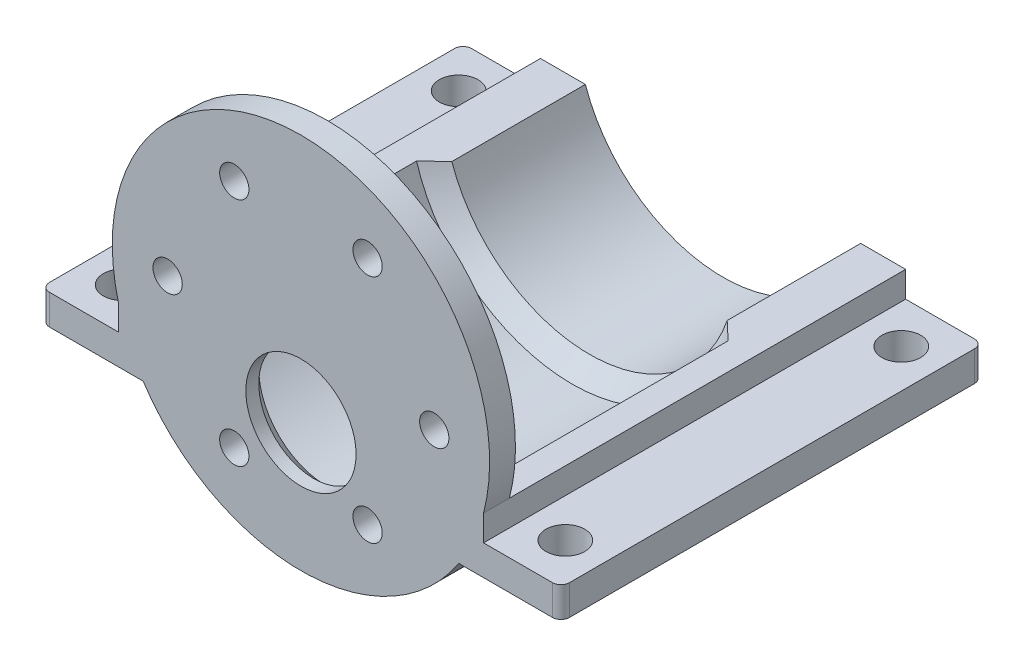
ISO-10303-21;
HEADER;
FILE_DESCRIPTION(('STEP AP214'),'2;1');
FILE_NAME('part.step','',(''),(''),'','','');
FILE_SCHEMA(('AUTOMOTIVE_DESIGN { 1 0 10303 214 1 1 1 1 }'));
ENDSEC;
DATA;
#1=APPLICATION_CONTEXT('core data for automotive mechanical design processes');
#2=APPLICATION_PROTOCOL_DEFINITION('international standard','automotive_design',2000,#1);
#3=PRODUCT_CONTEXT('',#1,'mechanical');
#4=PRODUCT('Part','Part','',(#3));
#5=PRODUCT_RELATED_PRODUCT_CATEGORY('part','',(#4));
#6=PRODUCT_DEFINITION_FORMATION('','',#4);
#7=PRODUCT_DEFINITION_CONTEXT('part definition',#1,'design');
#8=PRODUCT_DEFINITION('design','',#6,#7);
#9=PRODUCT_DEFINITION_SHAPE('','',#8);
#10=(LENGTH_UNIT() NAMED_UNIT(*) SI_UNIT(.MILLI.,.METRE.));
#11=(NAMED_UNIT(*) PLANE_ANGLE_UNIT() SI_UNIT($,.RADIAN.));
#12=(NAMED_UNIT(*) SI_UNIT($,.STERADIAN.) SOLID_ANGLE_UNIT());
#13=UNCERTAINTY_MEASURE_WITH_UNIT(LENGTH_MEASURE(1.E-05),#10,'distance_accuracy_value','');
#14=(GEOMETRIC_REPRESENTATION_CONTEXT(3) GLOBAL_UNCERTAINTY_ASSIGNED_CONTEXT((#13)) GLOBAL_UNIT_ASSIGNED_CONTEXT((#10,
#11,#12)) REPRESENTATION_CONTEXT('',''));
#15=CARTESIAN_POINT('',(0.,0.,0.));
#16=DIRECTION('',(0.,0.,1.));
#17=DIRECTION('',(1.,0.,0.));
#18=AXIS2_PLACEMENT_3D('',#15,#16,#17);
#19=CARTESIAN_POINT('',(0.,0.,91.));
#20=DIRECTION('',(0.,0.,1.));
#21=DIRECTION('',(1.,0.,0.));
#22=AXIS2_PLACEMENT_3D('',#19,#20,#21);
#23=CYLINDRICAL_SURFACE('',#22,21.9);
#24=CARTESIAN_POINT('',(0.,0.,45.));
#25=DIRECTION('',(0.,0.,1.));
#26=DIRECTION('',(1.,0.,0.));
#27=AXIS2_PLACEMENT_3D('',#24,#25,#26);
#28=CIRCLE('',#27,21.9);
#29=CARTESIAN_POINT('',(-18.3196615689264,-12.,45.));
#30=VERTEX_POINT('',#29);
#31=CARTESIAN_POINT('',(18.3196615689264,-12.,45.));
#32=VERTEX_POINT('',#31);
#33=EDGE_CURVE('E187',#30,#32,#28,.T.);
#34=ORIENTED_EDGE('',*,*,#33,.T.);
#35=DIRECTION('',(0.,0.,-1.));
#36=VECTOR('',#35,1.);
#37=CARTESIAN_POINT('',(18.3196615689264,-12.,107.527476698662));
#38=LINE('',#37,#36);
#39=CARTESIAN_POINT('',(18.3196615689264,-12.,94.));
#40=VERTEX_POINT('',#39);
#41=EDGE_CURVE('E226',#40,#32,#38,.T.);
#42=ORIENTED_EDGE('',*,*,#41,.F.);
#43=CARTESIAN_POINT('',(0.,0.,94.));
#44=DIRECTION('',(0.,0.,1.));
#45=DIRECTION('',(1.,0.,0.));
#46=AXIS2_PLACEMENT_3D('',#43,#44,#45);
#47=CIRCLE('',#46,21.9);
#48=CARTESIAN_POINT('',(-18.3196615689264,-12.,94.));
#49=VERTEX_POINT('',#48);
#50=EDGE_CURVE('E287',#49,#40,#47,.T.);
#51=ORIENTED_EDGE('',*,*,#50,.F.);
#52=DIRECTION('',(0.,0.,-1.));
#53=VECTOR('',#52,1.);
#54=CARTESIAN_POINT('',(-18.3196615689264,-12.,107.527476698662));
#55=LINE('',#54,#53);
#56=EDGE_CURVE('E239',#49,#30,#55,.T.);
#57=ORIENTED_EDGE('',*,*,#56,.T.);
#58=EDGE_LOOP('',(#34,#42,#51,#57));
#59=FACE_BOUND('',#58,.T.);
#60=ADVANCED_FACE('F43',(#59),#23,.T.);
#61=CARTESIAN_POINT('',(0.,0.,91.));
#62=DIRECTION('',(0.,0.,1.));
#63=DIRECTION('',(1.,0.,0.));
#64=AXIS2_PLACEMENT_3D('',#61,#62,#63);
#65=PLANE('',#64);
#66=CARTESIAN_POINT('',(0.,-7.,91.));
#67=DIRECTION('',(0.,0.,1.));
#68=DIRECTION('',(1.,0.,0.));
#69=AXIS2_PLACEMENT_3D('',#66,#67,#68);
#70=CIRCLE('',#69,7.89999999999998);
#71=CARTESIAN_POINT('',(7.89999999999998,-7.,91.));
#72=VERTEX_POINT('',#71);
#73=EDGE_CURVE('E547',#72,#72,#70,.T.);
#74=ORIENTED_EDGE('',*,*,#73,.T.);
#75=EDGE_LOOP('',(#74));
#76=FACE_BOUND('',#75,.T.);
#77=CARTESIAN_POINT('',(-7.73750000000007,-13.4017431235641,91.));
#78=DIRECTION('',(0.,0.,1.));
#79=DIRECTION('',(1.,0.,0.));
#80=AXIS2_PLACEMENT_3D('',#77,#78,#79);
#81=CIRCLE('',#80,1.7);
#82=CARTESIAN_POINT('',(-6.03750000000007,-13.4017431235641,91.));
#83=VERTEX_POINT('',#82);
#84=EDGE_CURVE('E299',#83,#83,#81,.T.);
#85=ORIENTED_EDGE('',*,*,#84,.T.);
#86=EDGE_LOOP('',(#85));
#87=FACE_BOUND('',#86,.T.);
#88=CARTESIAN_POINT('',(7.73749999999997,-13.4017431235642,91.));
#89=DIRECTION('',(0.,0.,1.));
#90=DIRECTION('',(1.,0.,0.));
#91=AXIS2_PLACEMENT_3D('',#88,#89,#90);
#92=CIRCLE('',#91,1.7);
#93=CARTESIAN_POINT('',(9.43749999999996,-13.4017431235642,91.));
#94=VERTEX_POINT('',#93);
#95=EDGE_CURVE('E296',#94,#94,#92,.T.);
#96=ORIENTED_EDGE('',*,*,#95,.T.);
#97=EDGE_LOOP('',(#96));
#98=FACE_BOUND('',#97,.T.);
#99=CARTESIAN_POINT('',(15.475,0.,91.));
#100=DIRECTION('',(0.,0.,1.));
#101=DIRECTION('',(1.,0.,0.));
#102=AXIS2_PLACEMENT_3D('',#99,#100,#101);
#103=CIRCLE('',#102,1.69999999999999);
#104=CARTESIAN_POINT('',(17.175,0.,91.));
#105=VERTEX_POINT('',#104);
#106=EDGE_CURVE('E293',#105,#105,#103,.T.);
#107=ORIENTED_EDGE('',*,*,#106,.T.);
#108=EDGE_LOOP('',(#107));
#109=FACE_BOUND('',#108,.T.);
#110=CARTESIAN_POINT('',(7.73750000000017,13.4017431235641,91.));
#111=DIRECTION('',(0.,0.,1.));
#112=DIRECTION('',(1.,0.,0.));
#113=AXIS2_PLACEMENT_3D('',#110,#111,#112);
#114=CIRCLE('',#113,1.7);
#115=CARTESIAN_POINT('',(9.43750000000017,13.4017431235641,91.));
#116=VERTEX_POINT('',#115);
#117=EDGE_CURVE('E290',#116,#116,#114,.T.);
#118=ORIENTED_EDGE('',*,*,#117,.T.);
#119=EDGE_LOOP('',(#118));
#120=FACE_BOUND('',#119,.T.);
#121=CARTESIAN_POINT('',(-7.73749999999986,13.4017431235643,91.));
#122=DIRECTION('',(0.,0.,1.));
#123=DIRECTION('',(1.,0.,0.));
#124=AXIS2_PLACEMENT_3D('',#121,#122,#123);
#125=CIRCLE('',#124,1.7);
#126=CARTESIAN_POINT('',(-6.03749999999986,13.4017431235643,91.));
#127=VERTEX_POINT('',#126);
#128=EDGE_CURVE('E286',#127,#127,#125,.T.);
#129=ORIENTED_EDGE('',*,*,#128,.T.);
#130=EDGE_LOOP('',(#129));
#131=FACE_BOUND('',#130,.T.);
#132=CARTESIAN_POINT('',(-15.475,1.23149278341851E-13,91.));
#133=DIRECTION('',(0.,0.,1.));
#134=DIRECTION('',(1.,0.,0.));
#135=AXIS2_PLACEMENT_3D('',#132,#133,#134);
#136=CIRCLE('',#135,1.7);
#137=CARTESIAN_POINT('',(-13.775,1.23149278341851E-13,91.));
#138=VERTEX_POINT('',#137);
#139=EDGE_CURVE('E283',#138,#138,#136,.T.);
#140=ORIENTED_EDGE('',*,*,#139,.T.);
#141=EDGE_LOOP('',(#140));
#142=FACE_BOUND('',#141,.T.);
#143=DIRECTION('',(1.,0.,0.));
#144=VECTOR('',#143,1.);
#145=CARTESIAN_POINT('',(0.,-5.5,91.));
#146=LINE('',#145,#144);
#147=CARTESIAN_POINT('',(18.0820352836731,-5.5,91.));
#148=VERTEX_POINT('',#147);
#149=CARTESIAN_POINT('',(21.1981131235778,-5.50000000000001,91.));
#150=VERTEX_POINT('',#149);
#151=EDGE_CURVE('E197',#148,#150,#146,.T.);
#152=ORIENTED_EDGE('',*,*,#151,.F.);
#153=CARTESIAN_POINT('',(0.,0.,91.));
#154=DIRECTION('',(0.,0.,1.));
#155=DIRECTION('',(1.,0.,0.));
#156=AXIS2_PLACEMENT_3D('',#153,#154,#155);
#157=CIRCLE('',#156,18.9);
#158=CARTESIAN_POINT('',(-18.0820352836731,-5.5,91.));
#159=VERTEX_POINT('',#158);
#160=EDGE_CURVE('E276',#159,#148,#157,.T.);
#161=ORIENTED_EDGE('',*,*,#160,.F.);
#162=DIRECTION('',(-1.,0.,0.));
#163=VECTOR('',#162,1.);
#164=CARTESIAN_POINT('',(0.,-5.5,91.));
#165=LINE('',#164,#163);
#166=CARTESIAN_POINT('',(-21.1981131235778,-5.5,91.));
#167=VERTEX_POINT('',#166);
#168=EDGE_CURVE('E273',#159,#167,#165,.T.);
#169=ORIENTED_EDGE('',*,*,#168,.T.);
#170=CARTESIAN_POINT('',(0.,0.,91.));
#171=DIRECTION('',(0.,0.,1.));
#172=DIRECTION('',(1.,0.,0.));
#173=AXIS2_PLACEMENT_3D('',#170,#171,#172);
#174=CIRCLE('',#173,21.9);
#175=EDGE_CURVE('E302',#150,#167,#174,.T.);
#176=ORIENTED_EDGE('',*,*,#175,.F.);
#177=EDGE_LOOP('',(#152,#161,#169,#176));
#178=FACE_BOUND('',#177,.T.);
#179=ADVANCED_FACE('F373',(#76,#87,#98,#109,#120,#131,#142,#178),#65,.F.);
#180=CARTESIAN_POINT('',(-7.73750000000007,-13.4017431235641,91.));
#181=DIRECTION('',(0.,0.,1.));
#182=DIRECTION('',(1.,0.,0.));
#183=AXIS2_PLACEMENT_3D('',#180,#181,#182);
#184=CYLINDRICAL_SURFACE('',#183,1.7);
#185=ORIENTED_EDGE('',*,*,#84,.F.);
#186=EDGE_LOOP('',(#185));
#187=FACE_BOUND('',#186,.T.);
#188=CARTESIAN_POINT('',(-7.73750000000007,-13.4017431235641,94.));
#189=DIRECTION('',(0.,0.,1.));
#190=DIRECTION('',(1.,0.,0.));
#191=AXIS2_PLACEMENT_3D('',#188,#189,#190);
#192=CIRCLE('',#191,1.7);
#193=CARTESIAN_POINT('',(-6.03750000000007,-13.4017431235641,94.));
#194=VERTEX_POINT('',#193);
#195=EDGE_CURVE('E323',#194,#194,#192,.T.);
#196=ORIENTED_EDGE('',*,*,#195,.T.);
#197=EDGE_LOOP('',(#196));
#198=FACE_BOUND('',#197,.T.);
#199=ADVANCED_FACE('F376',(#187,#198),#184,.F.);
#200=CARTESIAN_POINT('',(7.73749999999997,-13.4017431235642,91.));
#201=DIRECTION('',(0.,0.,1.));
#202=DIRECTION('',(1.,0.,0.));
#203=AXIS2_PLACEMENT_3D('',#200,#201,#202);
#204=CYLINDRICAL_SURFACE('',#203,1.7);
#205=ORIENTED_EDGE('',*,*,#95,.F.);
#206=EDGE_LOOP('',(#205));
#207=FACE_BOUND('',#206,.T.);
#208=CARTESIAN_POINT('',(7.73749999999997,-13.4017431235642,94.));
#209=DIRECTION('',(0.,0.,1.));
#210=DIRECTION('',(1.,0.,0.));
#211=AXIS2_PLACEMENT_3D('',#208,#209,#210);
#212=CIRCLE('',#211,1.7);
#213=CARTESIAN_POINT('',(9.43749999999996,-13.4017431235642,94.));
#214=VERTEX_POINT('',#213);
#215=EDGE_CURVE('E320',#214,#214,#212,.T.);
#216=ORIENTED_EDGE('',*,*,#215,.T.);
#217=EDGE_LOOP('',(#216));
#218=FACE_BOUND('',#217,.T.);
#219=ADVANCED_FACE('F388',(#207,#218),#204,.F.);
#220=CARTESIAN_POINT('',(0.,-7.,91.));
#221=DIRECTION('',(0.,0.,1.));
#222=DIRECTION('',(1.,0.,0.));
#223=AXIS2_PLACEMENT_3D('',#220,#221,#222);
#224=CYLINDRICAL_SURFACE('',#223,6.4);
#225=CARTESIAN_POINT('',(0.,-7.,92.5));
#226=DIRECTION('',(0.,0.,1.));
#227=DIRECTION('',(1.,0.,0.));
#228=AXIS2_PLACEMENT_3D('',#225,#226,#227);
#229=CIRCLE('',#228,6.4);
#230=CARTESIAN_POINT('',(6.4,-7.,92.5));
#231=VERTEX_POINT('',#230);
#232=EDGE_CURVE('E544',#231,#231,#229,.F.);
#233=ORIENTED_EDGE('',*,*,#232,.T.);
#234=EDGE_LOOP('',(#233));
#235=FACE_BOUND('',#234,.T.);
#236=CARTESIAN_POINT('',(0.,-7.,94.));
#237=DIRECTION('',(0.,0.,1.));
#238=DIRECTION('',(1.,0.,0.));
#239=AXIS2_PLACEMENT_3D('',#236,#237,#238);
#240=CIRCLE('',#239,6.4);
#241=CARTESIAN_POINT('',(6.4,-7.,94.));
#242=VERTEX_POINT('',#241);
#243=EDGE_CURVE('E317',#242,#242,#240,.T.);
#244=ORIENTED_EDGE('',*,*,#243,.T.);
#245=EDGE_LOOP('',(#244));
#246=FACE_BOUND('',#245,.T.);
#247=ADVANCED_FACE('F392',(#235,#246),#224,.F.);
#248=CARTESIAN_POINT('',(15.475,0.,91.));
#249=DIRECTION('',(0.,0.,1.));
#250=DIRECTION('',(1.,0.,0.));
#251=AXIS2_PLACEMENT_3D('',#248,#249,#250);
#252=CYLINDRICAL_SURFACE('',#251,1.69999999999999);
#253=ORIENTED_EDGE('',*,*,#106,.F.);
#254=EDGE_LOOP('',(#253));
#255=FACE_BOUND('',#254,.T.);
#256=CARTESIAN_POINT('',(15.475,0.,94.));
#257=DIRECTION('',(0.,0.,1.));
#258=DIRECTION('',(1.,0.,0.));
#259=AXIS2_PLACEMENT_3D('',#256,#257,#258);
#260=CIRCLE('',#259,1.69999999999999);
#261=CARTESIAN_POINT('',(17.175,0.,94.));
#262=VERTEX_POINT('',#261);
#263=EDGE_CURVE('E314',#262,#262,#260,.T.);
#264=ORIENTED_EDGE('',*,*,#263,.T.);
#265=EDGE_LOOP('',(#264));
#266=FACE_BOUND('',#265,.T.);
#267=ADVANCED_FACE('F396',(#255,#266),#252,.F.);
#268=CARTESIAN_POINT('',(7.73750000000017,13.4017431235641,91.));
#269=DIRECTION('',(0.,0.,1.));
#270=DIRECTION('',(1.,0.,0.));
#271=AXIS2_PLACEMENT_3D('',#268,#269,#270);
#272=CYLINDRICAL_SURFACE('',#271,1.7);
#273=ORIENTED_EDGE('',*,*,#117,.F.);
#274=EDGE_LOOP('',(#273));
#275=FACE_BOUND('',#274,.T.);
#276=CARTESIAN_POINT('',(7.73750000000017,13.4017431235641,94.));
#277=DIRECTION('',(0.,0.,1.));
#278=DIRECTION('',(1.,0.,0.));
#279=AXIS2_PLACEMENT_3D('',#276,#277,#278);
#280=CIRCLE('',#279,1.7);
#281=CARTESIAN_POINT('',(9.43750000000017,13.4017431235641,94.));
#282=VERTEX_POINT('',#281);
#283=EDGE_CURVE('E311',#282,#282,#280,.T.);
#284=ORIENTED_EDGE('',*,*,#283,.T.);
#285=EDGE_LOOP('',(#284));
#286=FACE_BOUND('',#285,.T.);
#287=ADVANCED_FACE('F400',(#275,#286),#272,.F.);
#288=CARTESIAN_POINT('',(-7.73749999999986,13.4017431235643,91.));
#289=DIRECTION('',(0.,0.,1.));
#290=DIRECTION('',(1.,0.,0.));
#291=AXIS2_PLACEMENT_3D('',#288,#289,#290);
#292=CYLINDRICAL_SURFACE('',#291,1.7);
#293=ORIENTED_EDGE('',*,*,#128,.F.);
#294=EDGE_LOOP('',(#293));
#295=FACE_BOUND('',#294,.T.);
#296=CARTESIAN_POINT('',(-7.73749999999986,13.4017431235643,94.));
#297=DIRECTION('',(0.,0.,1.));
#298=DIRECTION('',(1.,0.,0.));
#299=AXIS2_PLACEMENT_3D('',#296,#297,#298);
#300=CIRCLE('',#299,1.7);
#301=CARTESIAN_POINT('',(-6.03749999999986,13.4017431235643,94.));
#302=VERTEX_POINT('',#301);
#303=EDGE_CURVE('E308',#302,#302,#300,.T.);
#304=ORIENTED_EDGE('',*,*,#303,.T.);
#305=EDGE_LOOP('',(#304));
#306=FACE_BOUND('',#305,.T.);
#307=ADVANCED_FACE('F404',(#295,#306),#292,.F.);
#308=CARTESIAN_POINT('',(-15.475,1.23149278341851E-13,91.));
#309=DIRECTION('',(0.,0.,1.));
#310=DIRECTION('',(1.,0.,0.));
#311=AXIS2_PLACEMENT_3D('',#308,#309,#310);
#312=CYLINDRICAL_SURFACE('',#311,1.7);
#313=ORIENTED_EDGE('',*,*,#139,.F.);
#314=EDGE_LOOP('',(#313));
#315=FACE_BOUND('',#314,.T.);
#316=CARTESIAN_POINT('',(-15.475,1.23149278341851E-13,94.));
#317=DIRECTION('',(0.,0.,1.));
#318=DIRECTION('',(1.,0.,0.));
#319=AXIS2_PLACEMENT_3D('',#316,#317,#318);
#320=CIRCLE('',#319,1.7);
#321=CARTESIAN_POINT('',(-13.775,1.23149278341851E-13,94.));
#322=VERTEX_POINT('',#321);
#323=EDGE_CURVE('E201',#322,#322,#320,.T.);
#324=ORIENTED_EDGE('',*,*,#323,.T.);
#325=EDGE_LOOP('',(#324));
#326=FACE_BOUND('',#325,.T.);
#327=ADVANCED_FACE('F384',(#315,#326),#312,.F.);
#328=DIRECTION('',(0.,0.,-1.));
#329=VECTOR('',#328,1.);
#330=CARTESIAN_POINT('',(21.1981131235778,-5.50000000000001,107.527476698662));
#331=LINE('',#330,#329);
#332=CARTESIAN_POINT('',(21.1981131235778,-5.50000000000001,94.));
#333=VERTEX_POINT('',#332);
#334=EDGE_CURVE('E224',#333,#150,#331,.T.);
#335=ORIENTED_EDGE('',*,*,#334,.T.);
#336=ORIENTED_EDGE('',*,*,#175,.T.);
#337=DIRECTION('',(0.,0.,-1.));
#338=VECTOR('',#337,1.);
#339=CARTESIAN_POINT('',(-21.1981131235778,-5.49999999999998,107.527476698662));
#340=LINE('',#339,#338);
#341=CARTESIAN_POINT('',(-21.1981131235778,-5.50000000000001,94.));
#342=VERTEX_POINT('',#341);
#343=EDGE_CURVE('E242',#342,#167,#340,.T.);
#344=ORIENTED_EDGE('',*,*,#343,.F.);
#345=EDGE_CURVE('E326',#333,#342,#47,.T.);
#346=ORIENTED_EDGE('',*,*,#345,.F.);
#347=EDGE_LOOP('',(#335,#336,#344,#346));
#348=FACE_BOUND('',#347,.T.);
#349=ADVANCED_FACE('F380',(#348),#23,.T.);
#350=CARTESIAN_POINT('',(0.,0.,94.));
#351=DIRECTION('',(0.,0.,1.));
#352=DIRECTION('',(1.,0.,0.));
#353=AXIS2_PLACEMENT_3D('',#350,#351,#352);
#354=PLANE('',#353);
#355=ORIENTED_EDGE('',*,*,#323,.F.);
#356=EDGE_LOOP('',(#355));
#357=FACE_BOUND('',#356,.T.);
#358=ORIENTED_EDGE('',*,*,#303,.F.);
#359=EDGE_LOOP('',(#358));
#360=FACE_BOUND('',#359,.T.);
#361=ORIENTED_EDGE('',*,*,#283,.F.);
#362=EDGE_LOOP('',(#361));
#363=FACE_BOUND('',#362,.T.);
#364=ORIENTED_EDGE('',*,*,#263,.F.);
#365=EDGE_LOOP('',(#364));
#366=FACE_BOUND('',#365,.T.);
#367=ORIENTED_EDGE('',*,*,#243,.F.);
#368=EDGE_LOOP('',(#367));
#369=FACE_BOUND('',#368,.T.);
#370=ORIENTED_EDGE('',*,*,#215,.F.);
#371=EDGE_LOOP('',(#370));
#372=FACE_BOUND('',#371,.T.);
#373=ORIENTED_EDGE('',*,*,#195,.F.);
#374=EDGE_LOOP('',(#373));
#375=FACE_BOUND('',#374,.T.);
#376=DIRECTION('',(1.,0.,0.));
#377=VECTOR('',#376,1.);
#378=CARTESIAN_POINT('',(0.,-8.5,94.));
#379=LINE('',#378,#377);
#380=CARTESIAN_POINT('',(-29.1831612984686,-8.5,94.));
#381=VERTEX_POINT('',#380);
#382=CARTESIAN_POINT('',(-21.1981131235778,-8.5,94.));
#383=VERTEX_POINT('',#382);
#384=EDGE_CURVE('E245',#381,#383,#379,.T.);
#385=ORIENTED_EDGE('',*,*,#384,.F.);
#386=DIRECTION('',(0.,1.,0.));
#387=VECTOR('',#386,1.);
#388=CARTESIAN_POINT('',(-29.1831612984686,0.,94.));
#389=LINE('',#388,#387);
#390=CARTESIAN_POINT('',(-29.1831612984686,-12.,94.));
#391=VERTEX_POINT('',#390);
#392=EDGE_CURVE('E532',#381,#391,#389,.F.);
#393=ORIENTED_EDGE('',*,*,#392,.T.);
#394=DIRECTION('',(-1.,0.,0.));
#395=VECTOR('',#394,1.);
#396=CARTESIAN_POINT('',(0.,-12.,94.));
#397=LINE('',#396,#395);
#398=EDGE_CURVE('E249',#49,#391,#397,.T.);
#399=ORIENTED_EDGE('',*,*,#398,.F.);
#400=ORIENTED_EDGE('',*,*,#50,.T.);
#401=DIRECTION('',(1.,0.,0.));
#402=VECTOR('',#401,1.);
#403=CARTESIAN_POINT('',(0.,-12.,94.));
#404=LINE('',#403,#402);
#405=CARTESIAN_POINT('',(29.1831612984686,-12.,94.));
#406=VERTEX_POINT('',#405);
#407=EDGE_CURVE('E209',#40,#406,#404,.T.);
#408=ORIENTED_EDGE('',*,*,#407,.T.);
#409=DIRECTION('',(0.,1.,0.));
#410=VECTOR('',#409,1.);
#411=CARTESIAN_POINT('',(29.1831612984686,-8.5,94.));
#412=LINE('',#411,#410);
#413=CARTESIAN_POINT('',(29.1831612984686,-8.5,94.));
#414=VERTEX_POINT('',#413);
#415=EDGE_CURVE('E511',#406,#414,#412,.T.);
#416=ORIENTED_EDGE('',*,*,#415,.T.);
#417=DIRECTION('',(-1.,0.,0.));
#418=VECTOR('',#417,1.);
#419=CARTESIAN_POINT('',(0.,-8.5,94.));
#420=LINE('',#419,#418);
#421=CARTESIAN_POINT('',(21.1981131235778,-8.5,94.));
#422=VERTEX_POINT('',#421);
#423=EDGE_CURVE('E213',#414,#422,#420,.T.);
#424=ORIENTED_EDGE('',*,*,#423,.T.);
#425=DIRECTION('',(0.,-1.,0.));
#426=VECTOR('',#425,1.);
#427=CARTESIAN_POINT('',(21.1981131235778,0.,94.));
#428=LINE('',#427,#426);
#429=EDGE_CURVE('E219',#333,#422,#428,.T.);
#430=ORIENTED_EDGE('',*,*,#429,.F.);
#431=ORIENTED_EDGE('',*,*,#345,.T.);
#432=DIRECTION('',(0.,-1.,0.));
#433=VECTOR('',#432,1.);
#434=CARTESIAN_POINT('',(-21.1981131235778,0.,94.));
#435=LINE('',#434,#433);
#436=EDGE_CURVE('E223',#342,#383,#435,.T.);
#437=ORIENTED_EDGE('',*,*,#436,.T.);
#438=EDGE_LOOP('',(#385,#393,#399,#400,#408,#416,#424,#430,#431,#437));
#439=FACE_BOUND('',#438,.T.);
#440=ADVANCED_FACE('F370',(#357,#360,#363,#366,#369,#372,#375,#439),#354,.T.);
#441=CARTESIAN_POINT('',(0.,-5.5,63.5));
#442=DIRECTION('',(0.,-1.,0.));
#443=DIRECTION('',(0.,0.,-1.));
#444=AXIS2_PLACEMENT_3D('',#441,#442,#443);
#445=PLANE('',#444);
#446=CARTESIAN_POINT('',(15.9799874843505,-5.50000000000001,60.5));
#447=CARTESIAN_POINT('',(16.1556742028189,-5.50000000000001,60.6661235680092));
#448=CARTESIAN_POINT('',(16.3312170232763,-5.5,60.832399232589));
#449=CARTESIAN_POINT('',(16.6820373478474,-5.5,61.1652294821972));
#450=CARTESIAN_POINT('',(16.8573148525265,-5.5,61.3317840666294));
#451=CARTESIAN_POINT('',(17.207627716804,-5.5,61.6651475372354));
#452=CARTESIAN_POINT('',(17.3826630764827,-5.5,61.8319564233248));
#453=CARTESIAN_POINT('',(17.7325113207458,-5.5,62.1658080868658));
#454=CARTESIAN_POINT('',(17.9073242048549,-5.5,62.3328508648157));
#455=CARTESIAN_POINT('',(18.0820352836731,-5.5,62.5));
#456=B_SPLINE_CURVE_WITH_KNOTS('',3,(#446,#447,#448,#449,#450,#451,#452,#453,#454,#455),
.UNSPECIFIED.,.F.,.F.,(4,2,2,2,4),(0.,0.725372671352847,1.45074379462322,2.17611467721456,
2.90148710731814),.UNSPECIFIED.);
#457=CARTESIAN_POINT('',(15.9799874843505,-5.50000000000001,60.5));
#458=VERTEX_POINT('',#457);
#459=CARTESIAN_POINT('',(18.0820352836731,-5.5,62.5));
#460=VERTEX_POINT('',#459);
#461=EDGE_CURVE('E346',#458,#460,#456,.T.);
#462=ORIENTED_EDGE('',*,*,#461,.T.);
#463=DIRECTION('',(0.,0.,1.));
#464=VECTOR('',#463,1.);
#465=CARTESIAN_POINT('',(18.0820352836731,-5.5,63.5));
#466=LINE('',#465,#464);
#467=EDGE_CURVE('E278',#460,#148,#466,.T.);
#468=ORIENTED_EDGE('',*,*,#467,.T.);
#469=ORIENTED_EDGE('',*,*,#151,.T.);
#470=DIRECTION('',(0.,0.,1.));
#471=VECTOR('',#470,1.);
#472=CARTESIAN_POINT('',(21.1981131235778,-5.50000000000001,63.5));
#473=LINE('',#472,#471);
#474=CARTESIAN_POINT('',(21.1981131235778,-5.50000000000001,45.));
#475=VERTEX_POINT('',#474);
#476=EDGE_CURVE('E192',#475,#150,#473,.T.);
#477=ORIENTED_EDGE('',*,*,#476,.F.);
#478=DIRECTION('',(1.,0.,0.));
#479=VECTOR('',#478,1.);
#480=CARTESIAN_POINT('',(0.,-5.5,45.));
#481=LINE('',#480,#479);
#482=CARTESIAN_POINT('',(15.9799874843505,-5.50000000000001,45.));
#483=VERTEX_POINT('',#482);
#484=EDGE_CURVE('E175',#483,#475,#481,.T.);
#485=ORIENTED_EDGE('',*,*,#484,.F.);
#486=DIRECTION('',(0.,0.,1.));
#487=VECTOR('',#486,1.);
#488=CARTESIAN_POINT('',(15.9799874843505,-5.50000000000001,45.));
#489=LINE('',#488,#487);
#490=EDGE_CURVE('E267',#483,#458,#489,.T.);
#491=ORIENTED_EDGE('',*,*,#490,.T.);
#492=EDGE_LOOP('',(#462,#468,#469,#477,#485,#491));
#493=FACE_BOUND('',#492,.T.);
#494=ADVANCED_FACE('F194',(#493),#445,.F.);
#495=CARTESIAN_POINT('',(0.,-5.5,63.5));
#496=DIRECTION('',(0.,1.,0.));
#497=DIRECTION('',(0.,0.,1.));
#498=AXIS2_PLACEMENT_3D('',#495,#496,#497);
#499=PLANE('',#498);
#500=DIRECTION('',(0.,0.,1.));
#501=VECTOR('',#500,1.);
#502=CARTESIAN_POINT('',(-18.0820352836731,-5.5,63.5));
#503=LINE('',#502,#501);
#504=CARTESIAN_POINT('',(-18.0820352836731,-5.5,62.5));
#505=VERTEX_POINT('',#504);
#506=EDGE_CURVE('E280',#505,#159,#503,.T.);
#507=ORIENTED_EDGE('',*,*,#506,.F.);
#508=CARTESIAN_POINT('',(-18.0820352836731,-5.5,62.5));
#509=CARTESIAN_POINT('',(-17.9073242048549,-5.5,62.3328508648157));
#510=CARTESIAN_POINT('',(-17.7325113207458,-5.5,62.1658080868658));
#511=CARTESIAN_POINT('',(-17.3826630764827,-5.5,61.8319564233248));
#512=CARTESIAN_POINT('',(-17.207627716804,-5.5,61.6651475372354));
#513=CARTESIAN_POINT('',(-16.8573148525265,-5.5,61.3317840666294));
#514=CARTESIAN_POINT('',(-16.6820373478474,-5.5,61.1652294821972));
#515=CARTESIAN_POINT('',(-16.3312170232763,-5.5,60.832399232589));
#516=CARTESIAN_POINT('',(-16.1556742028189,-5.5,60.6661235680092));
#517=CARTESIAN_POINT('',(-15.9799874843505,-5.5,60.5));
#518=B_SPLINE_CURVE_WITH_KNOTS('',3,(#508,#509,#510,#511,#512,#513,#514,#515,#516,#517),
.UNSPECIFIED.,.F.,.F.,(4,2,2,2,4),(0.,0.72537243010358,1.45074331269492,2.17611443596529,
2.90148710731813),.UNSPECIFIED.);
#519=CARTESIAN_POINT('',(-15.9799874843505,-5.5,60.5));
#520=VERTEX_POINT('',#519);
#521=EDGE_CURVE('E354',#505,#520,#518,.T.);
#522=ORIENTED_EDGE('',*,*,#521,.T.);
#523=DIRECTION('',(0.,0.,1.));
#524=VECTOR('',#523,1.);
#525=CARTESIAN_POINT('',(-15.9799874843505,-5.5,45.));
#526=LINE('',#525,#524);
#527=CARTESIAN_POINT('',(-15.9799874843505,-5.5,45.));
#528=VERTEX_POINT('',#527);
#529=EDGE_CURVE('E269',#528,#520,#526,.T.);
#530=ORIENTED_EDGE('',*,*,#529,.F.);
#531=DIRECTION('',(-1.,0.,0.));
#532=VECTOR('',#531,1.);
#533=CARTESIAN_POINT('',(0.,-5.5,45.));
#534=LINE('',#533,#532);
#535=CARTESIAN_POINT('',(-21.1981131235778,-5.5,45.));
#536=VERTEX_POINT('',#535);
#537=EDGE_CURVE('E264',#528,#536,#534,.T.);
#538=ORIENTED_EDGE('',*,*,#537,.T.);
#539=DIRECTION('',(0.,0.,1.));
#540=VECTOR('',#539,1.);
#541=CARTESIAN_POINT('',(-21.1981131235778,-5.5,63.5));
#542=LINE('',#541,#540);
#543=EDGE_CURVE('E202',#536,#167,#542,.T.);
#544=ORIENTED_EDGE('',*,*,#543,.T.);
#545=ORIENTED_EDGE('',*,*,#168,.F.);
#546=EDGE_LOOP('',(#507,#522,#530,#538,#544,#545));
#547=FACE_BOUND('',#546,.T.);
#548=ADVANCED_FACE('F369',(#547),#499,.T.);
#549=CARTESIAN_POINT('',(0.,0.,63.5));
#550=DIRECTION('',(0.,0.,1.));
#551=DIRECTION('',(1.,0.,0.));
#552=AXIS2_PLACEMENT_3D('',#549,#550,#551);
#553=CYLINDRICAL_SURFACE('',#552,18.9);
#554=ORIENTED_EDGE('',*,*,#160,.T.);
#555=ORIENTED_EDGE('',*,*,#467,.F.);
#556=CARTESIAN_POINT('',(0.,0.,62.5));
#557=DIRECTION('',(0.,0.,1.));
#558=DIRECTION('',(1.,0.,0.));
#559=AXIS2_PLACEMENT_3D('',#556,#557,#558);
#560=CIRCLE('',#559,18.9);
#561=EDGE_CURVE('E549',#460,#505,#560,.F.);
#562=ORIENTED_EDGE('',*,*,#561,.T.);
#563=ORIENTED_EDGE('',*,*,#506,.T.);
#564=EDGE_LOOP('',(#554,#555,#562,#563));
#565=FACE_BOUND('',#564,.T.);
#566=ADVANCED_FACE('F486',(#565),#553,.F.);
#567=CARTESIAN_POINT('',(0.,0.,45.));
#568=DIRECTION('',(0.,0.,1.));
#569=DIRECTION('',(1.,0.,0.));
#570=AXIS2_PLACEMENT_3D('',#567,#568,#569);
#571=CYLINDRICAL_SURFACE('',#570,16.9);
#572=ORIENTED_EDGE('',*,*,#529,.T.);
#573=CARTESIAN_POINT('',(0.,0.,60.5));
#574=DIRECTION('',(0.,0.,1.));
#575=DIRECTION('',(1.,0.,0.));
#576=AXIS2_PLACEMENT_3D('',#573,#574,#575);
#577=CIRCLE('',#576,16.9);
#578=EDGE_CURVE('E305',#520,#458,#577,.T.);
#579=ORIENTED_EDGE('',*,*,#578,.T.);
#580=ORIENTED_EDGE('',*,*,#490,.F.);
#581=CARTESIAN_POINT('',(0.,0.,45.));
#582=DIRECTION('',(0.,0.,1.));
#583=DIRECTION('',(1.,0.,0.));
#584=AXIS2_PLACEMENT_3D('',#581,#582,#583);
#585=CIRCLE('',#584,16.9);
#586=EDGE_CURVE('E183',#528,#483,#585,.T.);
#587=ORIENTED_EDGE('',*,*,#586,.F.);
#588=EDGE_LOOP('',(#572,#579,#580,#587));
#589=FACE_BOUND('',#588,.T.);
#590=ADVANCED_FACE('F484',(#589),#571,.F.);
#591=CARTESIAN_POINT('',(0.,0.,45.));
#592=DIRECTION('',(0.,0.,1.));
#593=DIRECTION('',(1.,0.,0.));
#594=AXIS2_PLACEMENT_3D('',#591,#592,#593);
#595=PLANE('',#594);
#596=DIRECTION('',(-1.,0.,0.));
#597=VECTOR('',#596,1.);
#598=CARTESIAN_POINT('',(0.,-12.,45.));
#599=LINE('',#598,#597);
#600=CARTESIAN_POINT('',(-29.1831612984686,-12.,45.));
#601=VERTEX_POINT('',#600);
#602=EDGE_CURVE('E235',#30,#601,#599,.T.);
#603=ORIENTED_EDGE('',*,*,#602,.T.);
#604=DIRECTION('',(0.,1.,0.));
#605=VECTOR('',#604,1.);
#606=CARTESIAN_POINT('',(-29.1831612984686,-8.5,45.));
#607=LINE('',#606,#605);
#608=CARTESIAN_POINT('',(-29.1831612984686,-8.5,45.));
#609=VERTEX_POINT('',#608);
#610=EDGE_CURVE('E11',#601,#609,#607,.T.);
#611=ORIENTED_EDGE('',*,*,#610,.T.);
#612=DIRECTION('',(1.,0.,0.));
#613=VECTOR('',#612,1.);
#614=CARTESIAN_POINT('',(0.,-8.5,45.));
#615=LINE('',#614,#613);
#616=CARTESIAN_POINT('',(-21.1981131235778,-8.5,45.));
#617=VERTEX_POINT('',#616);
#618=EDGE_CURVE('E237',#609,#617,#615,.T.);
#619=ORIENTED_EDGE('',*,*,#618,.T.);
#620=DIRECTION('',(0.,-1.,0.));
#621=VECTOR('',#620,1.);
#622=CARTESIAN_POINT('',(-21.1981131235778,0.,45.));
#623=LINE('',#622,#621);
#624=EDGE_CURVE('E188',#536,#617,#623,.T.);
#625=ORIENTED_EDGE('',*,*,#624,.F.);
#626=ORIENTED_EDGE('',*,*,#537,.F.);
#627=ORIENTED_EDGE('',*,*,#586,.T.);
#628=ORIENTED_EDGE('',*,*,#484,.T.);
#629=DIRECTION('',(0.,-1.,0.));
#630=VECTOR('',#629,1.);
#631=CARTESIAN_POINT('',(21.1981131235778,0.,45.));
#632=LINE('',#631,#630);
#633=CARTESIAN_POINT('',(21.1981131235778,-8.5,45.));
#634=VERTEX_POINT('',#633);
#635=EDGE_CURVE('E180',#475,#634,#632,.T.);
#636=ORIENTED_EDGE('',*,*,#635,.T.);
#637=DIRECTION('',(-1.,0.,0.));
#638=VECTOR('',#637,1.);
#639=CARTESIAN_POINT('',(0.,-8.5,45.));
#640=LINE('',#639,#638);
#641=CARTESIAN_POINT('',(29.1831612984686,-8.5,45.));
#642=VERTEX_POINT('',#641);
#643=EDGE_CURVE('E210',#642,#634,#640,.T.);
#644=ORIENTED_EDGE('',*,*,#643,.F.);
#645=DIRECTION('',(0.,1.,0.));
#646=VECTOR('',#645,1.);
#647=CARTESIAN_POINT('',(29.1831612984686,0.,45.));
#648=LINE('',#647,#646);
#649=CARTESIAN_POINT('',(29.1831612984686,-12.,45.));
#650=VERTEX_POINT('',#649);
#651=EDGE_CURVE('E51',#642,#650,#648,.F.);
#652=ORIENTED_EDGE('',*,*,#651,.T.);
#653=DIRECTION('',(1.,0.,0.));
#654=VECTOR('',#653,1.);
#655=CARTESIAN_POINT('',(0.,-12.,45.));
#656=LINE('',#655,#654);
#657=EDGE_CURVE('E229',#32,#650,#656,.T.);
#658=ORIENTED_EDGE('',*,*,#657,.F.);
#659=ORIENTED_EDGE('',*,*,#33,.F.);
#660=EDGE_LOOP('',(#603,#611,#619,#625,#626,#627,#628,#636,#644,#652,#658,#659));
#661=FACE_BOUND('',#660,.T.);
#662=ADVANCED_FACE('F178',(#661),#595,.F.);
#663=CARTESIAN_POINT('',(0.,-12.,107.527476698662));
#664=DIRECTION('',(0.,-1.,0.));
#665=DIRECTION('',(1.,0.,0.));
#666=AXIS2_PLACEMENT_3D('',#663,#664,#665);
#667=PLANE('',#666);
#668=CARTESIAN_POINT('',(-25.6906372110232,-12.,89.));
#669=DIRECTION('',(0.,-1.,0.));
#670=DIRECTION('',(1.,0.,0.));
#671=AXIS2_PLACEMENT_3D('',#668,#669,#670);
#672=CIRCLE('',#671,2.25);
#673=CARTESIAN_POINT('',(-23.4406372110232,-12.,89.));
#674=VERTEX_POINT('',#673);
#675=EDGE_CURVE('E221',#674,#674,#672,.T.);
#676=ORIENTED_EDGE('',*,*,#675,.F.);
#677=EDGE_LOOP('',(#676));
#678=FACE_BOUND('',#677,.T.);
#679=CARTESIAN_POINT('',(-25.6906372110232,-12.,50.));
#680=DIRECTION('',(0.,-1.,0.));
#681=DIRECTION('',(1.,0.,0.));
#682=AXIS2_PLACEMENT_3D('',#679,#680,#681);
#683=CIRCLE('',#682,2.25);
#684=CARTESIAN_POINT('',(-23.4406372110232,-12.,50.));
#685=VERTEX_POINT('',#684);
#686=EDGE_CURVE('E340',#685,#685,#683,.T.);
#687=ORIENTED_EDGE('',*,*,#686,.F.);
#688=EDGE_LOOP('',(#687));
#689=FACE_BOUND('',#688,.T.);
#690=ORIENTED_EDGE('',*,*,#398,.T.);
#691=CARTESIAN_POINT('',(-29.1831612984686,-12.,93.));
#692=DIRECTION('',(0.,-1.,0.));
#693=DIRECTION('',(1.,0.,0.));
#694=AXIS2_PLACEMENT_3D('',#691,#692,#693);
#695=CIRCLE('',#694,1.);
#696=CARTESIAN_POINT('',(-30.1831612984686,-12.,93.));
#697=VERTEX_POINT('',#696);
#698=EDGE_CURVE('E528',#391,#697,#695,.T.);
#699=ORIENTED_EDGE('',*,*,#698,.T.);
#700=DIRECTION('',(0.,0.,-1.));
#701=VECTOR('',#700,1.);
#702=CARTESIAN_POINT('',(-30.1831612984686,-12.,107.527476698662));
#703=LINE('',#702,#701);
#704=CARTESIAN_POINT('',(-30.1831612984686,-12.,46.));
#705=VERTEX_POINT('',#704);
#706=EDGE_CURVE('E252',#697,#705,#703,.T.);
#707=ORIENTED_EDGE('',*,*,#706,.T.);
#708=CARTESIAN_POINT('',(-29.1831612984686,-12.,46.));
#709=DIRECTION('',(0.,-1.,0.));
#710=DIRECTION('',(1.,0.,0.));
#711=AXIS2_PLACEMENT_3D('',#708,#709,#710);
#712=CIRCLE('',#711,1.);
#713=EDGE_CURVE('E530',#705,#601,#712,.T.);
#714=ORIENTED_EDGE('',*,*,#713,.T.);
#715=ORIENTED_EDGE('',*,*,#602,.F.);
#716=ORIENTED_EDGE('',*,*,#56,.F.);
#717=EDGE_LOOP('',(#690,#699,#707,#714,#715,#716));
#718=FACE_BOUND('',#717,.T.);
#719=ADVANCED_FACE('F477',(#678,#689,#718),#667,.T.);
#720=CARTESIAN_POINT('',(-30.1831612984686,0.,107.527476698662));
#721=DIRECTION('',(-1.,0.,0.));
#722=DIRECTION('',(0.,0.,1.));
#723=AXIS2_PLACEMENT_3D('',#720,#721,#722);
#724=PLANE('',#723);
#725=ORIENTED_EDGE('',*,*,#706,.F.);
#726=DIRECTION('',(0.,1.,0.));
#727=VECTOR('',#726,1.);
#728=CARTESIAN_POINT('',(-30.1831612984686,0.,93.));
#729=LINE('',#728,#727);
#730=CARTESIAN_POINT('',(-30.1831612984686,-8.5,93.));
#731=VERTEX_POINT('',#730);
#732=EDGE_CURVE('E539',#697,#731,#729,.T.);
#733=ORIENTED_EDGE('',*,*,#732,.T.);
#734=DIRECTION('',(0.,0.,-1.));
#735=VECTOR('',#734,1.);
#736=CARTESIAN_POINT('',(-30.1831612984686,-8.5,107.527476698662));
#737=LINE('',#736,#735);
#738=CARTESIAN_POINT('',(-30.1831612984686,-8.5,46.));
#739=VERTEX_POINT('',#738);
#740=EDGE_CURVE('E248',#731,#739,#737,.T.);
#741=ORIENTED_EDGE('',*,*,#740,.T.);
#742=DIRECTION('',(0.,1.,0.));
#743=VECTOR('',#742,1.);
#744=CARTESIAN_POINT('',(-30.1831612984686,-12.,46.));
#745=LINE('',#744,#743);
#746=EDGE_CURVE('E542',#739,#705,#745,.F.);
#747=ORIENTED_EDGE('',*,*,#746,.T.);
#748=EDGE_LOOP('',(#725,#733,#741,#747));
#749=FACE_BOUND('',#748,.T.);
#750=ADVANCED_FACE('F473',(#749),#724,.T.);
#751=CARTESIAN_POINT('',(0.,-8.5,107.527476698662));
#752=DIRECTION('',(0.,1.,0.));
#753=DIRECTION('',(0.,0.,1.));
#754=AXIS2_PLACEMENT_3D('',#751,#752,#753);
#755=PLANE('',#754);
#756=CARTESIAN_POINT('',(-25.6906372110232,-8.5,89.));
#757=DIRECTION('',(0.,1.,0.));
#758=DIRECTION('',(0.,0.,1.));
#759=AXIS2_PLACEMENT_3D('',#756,#757,#758);
#760=CIRCLE('',#759,2.25);
#761=CARTESIAN_POINT('',(-25.6906372110232,-8.5,91.25));
#762=VERTEX_POINT('',#761);
#763=EDGE_CURVE('E341',#762,#762,#760,.T.);
#764=ORIENTED_EDGE('',*,*,#763,.F.);
#765=EDGE_LOOP('',(#764));
#766=FACE_BOUND('',#765,.T.);
#767=CARTESIAN_POINT('',(-25.6906372110232,-8.5,50.));
#768=DIRECTION('',(0.,1.,0.));
#769=DIRECTION('',(0.,0.,1.));
#770=AXIS2_PLACEMENT_3D('',#767,#768,#769);
#771=CIRCLE('',#770,2.25);
#772=CARTESIAN_POINT('',(-25.6906372110232,-8.5,52.25));
#773=VERTEX_POINT('',#772);
#774=EDGE_CURVE('E337',#773,#773,#771,.T.);
#775=ORIENTED_EDGE('',*,*,#774,.F.);
#776=EDGE_LOOP('',(#775));
#777=FACE_BOUND('',#776,.T.);
#778=ORIENTED_EDGE('',*,*,#740,.F.);
#779=CARTESIAN_POINT('',(-29.1831612984686,-8.5,93.));
#780=DIRECTION('',(0.,1.,0.));
#781=DIRECTION('',(0.,0.,1.));
#782=AXIS2_PLACEMENT_3D('',#779,#780,#781);
#783=CIRCLE('',#782,1.);
#784=EDGE_CURVE('E535',#731,#381,#783,.T.);
#785=ORIENTED_EDGE('',*,*,#784,.T.);
#786=ORIENTED_EDGE('',*,*,#384,.T.);
#787=DIRECTION('',(0.,0.,-1.));
#788=VECTOR('',#787,1.);
#789=CARTESIAN_POINT('',(-21.1981131235778,-8.5,107.527476698662));
#790=LINE('',#789,#788);
#791=EDGE_CURVE('E247',#383,#617,#790,.T.);
#792=ORIENTED_EDGE('',*,*,#791,.T.);
#793=ORIENTED_EDGE('',*,*,#618,.F.);
#794=CARTESIAN_POINT('',(-29.1831612984686,-8.5,46.));
#795=DIRECTION('',(0.,1.,0.));
#796=DIRECTION('',(0.,0.,1.));
#797=AXIS2_PLACEMENT_3D('',#794,#795,#796);
#798=CIRCLE('',#797,1.);
#799=EDGE_CURVE('E537',#609,#739,#798,.T.);
#800=ORIENTED_EDGE('',*,*,#799,.T.);
#801=EDGE_LOOP('',(#778,#785,#786,#792,#793,#800));
#802=FACE_BOUND('',#801,.T.);
#803=ADVANCED_FACE('F469',(#766,#777,#802),#755,.T.);
#804=CARTESIAN_POINT('',(-21.1981131235778,0.,107.527476698662));
#805=DIRECTION('',(1.,0.,0.));
#806=DIRECTION('',(0.,0.,-1.));
#807=AXIS2_PLACEMENT_3D('',#804,#805,#806);
#808=PLANE('',#807);
#809=ORIENTED_EDGE('',*,*,#436,.F.);
#810=ORIENTED_EDGE('',*,*,#343,.T.);
#811=ORIENTED_EDGE('',*,*,#543,.F.);
#812=ORIENTED_EDGE('',*,*,#624,.T.);
#813=ORIENTED_EDGE('',*,*,#791,.F.);
#814=EDGE_LOOP('',(#809,#810,#811,#812,#813));
#815=FACE_BOUND('',#814,.T.);
#816=ADVANCED_FACE('F466',(#815),#808,.F.);
#817=CARTESIAN_POINT('',(21.1981131235778,0.,107.527476698662));
#818=DIRECTION('',(1.,0.,0.));
#819=DIRECTION('',(0.,0.,-1.));
#820=AXIS2_PLACEMENT_3D('',#817,#818,#819);
#821=PLANE('',#820);
#822=ORIENTED_EDGE('',*,*,#334,.F.);
#823=ORIENTED_EDGE('',*,*,#429,.T.);
#824=DIRECTION('',(0.,0.,-1.));
#825=VECTOR('',#824,1.);
#826=CARTESIAN_POINT('',(21.1981131235778,-8.5,107.527476698662));
#827=LINE('',#826,#825);
#828=EDGE_CURVE('E208',#422,#634,#827,.T.);
#829=ORIENTED_EDGE('',*,*,#828,.T.);
#830=ORIENTED_EDGE('',*,*,#635,.F.);
#831=ORIENTED_EDGE('',*,*,#476,.T.);
#832=EDGE_LOOP('',(#822,#823,#829,#830,#831));
#833=FACE_BOUND('',#832,.T.);
#834=ADVANCED_FACE('F205',(#833),#821,.T.);
#835=CARTESIAN_POINT('',(0.,-12.,107.527476698662));
#836=DIRECTION('',(0.,1.,0.));
#837=DIRECTION('',(0.,0.,1.));
#838=AXIS2_PLACEMENT_3D('',#835,#836,#837);
#839=PLANE('',#838);
#840=CARTESIAN_POINT('',(25.6906372110232,-12.,50.));
#841=DIRECTION('',(0.,1.,0.));
#842=DIRECTION('',(0.,0.,1.));
#843=AXIS2_PLACEMENT_3D('',#840,#841,#842);
#844=CIRCLE('',#843,2.25);
#845=CARTESIAN_POINT('',(25.6906372110232,-12.,52.25));
#846=VERTEX_POINT('',#845);
#847=EDGE_CURVE('E336',#846,#846,#844,.T.);
#848=ORIENTED_EDGE('',*,*,#847,.T.);
#849=EDGE_LOOP('',(#848));
#850=FACE_BOUND('',#849,.T.);
#851=CARTESIAN_POINT('',(25.6906372110232,-12.,89.));
#852=DIRECTION('',(0.,1.,0.));
#853=DIRECTION('',(0.,0.,1.));
#854=AXIS2_PLACEMENT_3D('',#851,#852,#853);
#855=CIRCLE('',#854,2.25);
#856=CARTESIAN_POINT('',(25.6906372110232,-12.,91.25));
#857=VERTEX_POINT('',#856);
#858=EDGE_CURVE('E332',#857,#857,#855,.T.);
#859=ORIENTED_EDGE('',*,*,#858,.T.);
#860=EDGE_LOOP('',(#859));
#861=FACE_BOUND('',#860,.T.);
#862=DIRECTION('',(0.,0.,-1.));
#863=VECTOR('',#862,1.);
#864=CARTESIAN_POINT('',(30.1831612984686,-12.,107.527476698662));
#865=LINE('',#864,#863);
#866=CARTESIAN_POINT('',(30.1831612984686,-12.,93.));
#867=VERTEX_POINT('',#866);
#868=CARTESIAN_POINT('',(30.1831612984686,-12.,46.));
#869=VERTEX_POINT('',#868);
#870=EDGE_CURVE('E230',#867,#869,#865,.T.);
#871=ORIENTED_EDGE('',*,*,#870,.F.);
#872=CARTESIAN_POINT('',(29.1831612984686,-12.,93.));
#873=DIRECTION('',(0.,1.,0.));
#874=DIRECTION('',(0.,0.,1.));
#875=AXIS2_PLACEMENT_3D('',#872,#873,#874);
#876=CIRCLE('',#875,1.);
#877=EDGE_CURVE('E517',#867,#406,#876,.F.);
#878=ORIENTED_EDGE('',*,*,#877,.T.);
#879=ORIENTED_EDGE('',*,*,#407,.F.);
#880=ORIENTED_EDGE('',*,*,#41,.T.);
#881=ORIENTED_EDGE('',*,*,#657,.T.);
#882=CARTESIAN_POINT('',(29.1831612984686,-12.,46.));
#883=DIRECTION('',(0.,1.,0.));
#884=DIRECTION('',(0.,0.,1.));
#885=AXIS2_PLACEMENT_3D('',#882,#883,#884);
#886=CIRCLE('',#885,1.);
#887=EDGE_CURVE('E64',#650,#869,#886,.F.);
#888=ORIENTED_EDGE('',*,*,#887,.T.);
#889=EDGE_LOOP('',(#871,#878,#879,#880,#881,#888));
#890=FACE_BOUND('',#889,.T.);
#891=ADVANCED_FACE('F421',(#850,#861,#890),#839,.F.);
#892=CARTESIAN_POINT('',(30.1831612984686,0.,107.527476698662));
#893=DIRECTION('',(-1.,0.,0.));
#894=DIRECTION('',(0.,0.,1.));
#895=AXIS2_PLACEMENT_3D('',#892,#893,#894);
#896=PLANE('',#895);
#897=DIRECTION('',(0.,0.,-1.));
#898=VECTOR('',#897,1.);
#899=CARTESIAN_POINT('',(30.1831612984686,-8.5,107.527476698662));
#900=LINE('',#899,#898);
#901=CARTESIAN_POINT('',(30.1831612984686,-8.5,93.));
#902=VERTEX_POINT('',#901);
#903=CARTESIAN_POINT('',(30.1831612984686,-8.5,46.));
#904=VERTEX_POINT('',#903);
#905=EDGE_CURVE('E215',#902,#904,#900,.T.);
#906=ORIENTED_EDGE('',*,*,#905,.F.);
#907=DIRECTION('',(0.,1.,0.));
#908=VECTOR('',#907,1.);
#909=CARTESIAN_POINT('',(30.1831612984686,-12.,93.));
#910=LINE('',#909,#908);
#911=EDGE_CURVE('E521',#902,#867,#910,.F.);
#912=ORIENTED_EDGE('',*,*,#911,.T.);
#913=ORIENTED_EDGE('',*,*,#870,.T.);
#914=DIRECTION('',(0.,1.,0.));
#915=VECTOR('',#914,1.);
#916=CARTESIAN_POINT('',(30.1831612984686,0.,46.));
#917=LINE('',#916,#915);
#918=EDGE_CURVE('E523',#869,#904,#917,.T.);
#919=ORIENTED_EDGE('',*,*,#918,.T.);
#920=EDGE_LOOP('',(#906,#912,#913,#919));
#921=FACE_BOUND('',#920,.T.);
#922=ADVANCED_FACE('F447',(#921),#896,.F.);
#923=CARTESIAN_POINT('',(0.,-8.5,107.527476698662));
#924=DIRECTION('',(0.,-1.,0.));
#925=DIRECTION('',(1.,0.,0.));
#926=AXIS2_PLACEMENT_3D('',#923,#924,#925);
#927=PLANE('',#926);
#928=CARTESIAN_POINT('',(25.6906372110232,-8.5,50.));
#929=DIRECTION('',(0.,-1.,0.));
#930=DIRECTION('',(1.,0.,0.));
#931=AXIS2_PLACEMENT_3D('',#928,#929,#930);
#932=CIRCLE('',#931,2.25);
#933=CARTESIAN_POINT('',(27.9406372110232,-8.5,50.));
#934=VERTEX_POINT('',#933);
#935=EDGE_CURVE('E333',#934,#934,#932,.T.);
#936=ORIENTED_EDGE('',*,*,#935,.T.);
#937=EDGE_LOOP('',(#936));
#938=FACE_BOUND('',#937,.T.);
#939=CARTESIAN_POINT('',(25.6906372110232,-8.5,89.));
#940=DIRECTION('',(0.,-1.,0.));
#941=DIRECTION('',(1.,0.,0.));
#942=AXIS2_PLACEMENT_3D('',#939,#940,#941);
#943=CIRCLE('',#942,2.25);
#944=CARTESIAN_POINT('',(27.9406372110232,-8.5,89.));
#945=VERTEX_POINT('',#944);
#946=EDGE_CURVE('E329',#945,#945,#943,.T.);
#947=ORIENTED_EDGE('',*,*,#946,.T.);
#948=EDGE_LOOP('',(#947));
#949=FACE_BOUND('',#948,.T.);
#950=ORIENTED_EDGE('',*,*,#423,.F.);
#951=CARTESIAN_POINT('',(29.1831612984686,-8.5,93.));
#952=DIRECTION('',(0.,-1.,0.));
#953=DIRECTION('',(1.,0.,0.));
#954=AXIS2_PLACEMENT_3D('',#951,#952,#953);
#955=CIRCLE('',#954,1.);
#956=EDGE_CURVE('E525',#414,#902,#955,.F.);
#957=ORIENTED_EDGE('',*,*,#956,.T.);
#958=ORIENTED_EDGE('',*,*,#905,.T.);
#959=CARTESIAN_POINT('',(29.1831612984686,-8.5,46.));
#960=DIRECTION('',(0.,-1.,0.));
#961=DIRECTION('',(1.,0.,0.));
#962=AXIS2_PLACEMENT_3D('',#959,#960,#961);
#963=CIRCLE('',#962,1.);
#964=EDGE_CURVE('E513',#904,#642,#963,.F.);
#965=ORIENTED_EDGE('',*,*,#964,.T.);
#966=ORIENTED_EDGE('',*,*,#643,.T.);
#967=ORIENTED_EDGE('',*,*,#828,.F.);
#968=EDGE_LOOP('',(#950,#957,#958,#965,#966,#967));
#969=FACE_BOUND('',#968,.T.);
#970=ADVANCED_FACE('F436',(#938,#949,#969),#927,.F.);
#971=CARTESIAN_POINT('',(25.6906372110232,-21.9,89.));
#972=DIRECTION('',(0.,1.,0.));
#973=DIRECTION('',(0.,0.,1.));
#974=AXIS2_PLACEMENT_3D('',#971,#972,#973);
#975=CYLINDRICAL_SURFACE('',#974,2.25);
#976=ORIENTED_EDGE('',*,*,#946,.F.);
#977=EDGE_LOOP('',(#976));
#978=FACE_BOUND('',#977,.T.);
#979=ORIENTED_EDGE('',*,*,#858,.F.);
#980=EDGE_LOOP('',(#979));
#981=FACE_BOUND('',#980,.T.);
#982=ADVANCED_FACE('F433',(#978,#981),#975,.F.);
#983=CARTESIAN_POINT('',(25.6906372110232,-21.9,50.));
#984=DIRECTION('',(0.,1.,0.));
#985=DIRECTION('',(0.,0.,1.));
#986=AXIS2_PLACEMENT_3D('',#983,#984,#985);
#987=CYLINDRICAL_SURFACE('',#986,2.25);
#988=ORIENTED_EDGE('',*,*,#935,.F.);
#989=EDGE_LOOP('',(#988));
#990=FACE_BOUND('',#989,.T.);
#991=ORIENTED_EDGE('',*,*,#847,.F.);
#992=EDGE_LOOP('',(#991));
#993=FACE_BOUND('',#992,.T.);
#994=ADVANCED_FACE('F435',(#990,#993),#987,.F.);
#995=CARTESIAN_POINT('',(-25.6906372110232,-21.9,50.));
#996=DIRECTION('',(0.,1.,0.));
#997=DIRECTION('',(0.,0.,1.));
#998=AXIS2_PLACEMENT_3D('',#995,#996,#997);
#999=CYLINDRICAL_SURFACE('',#998,2.25);
#1000=ORIENTED_EDGE('',*,*,#686,.T.);
#1001=EDGE_LOOP('',(#1000));
#1002=FACE_BOUND('',#1001,.T.);
#1003=ORIENTED_EDGE('',*,*,#774,.T.);
#1004=EDGE_LOOP('',(#1003));
#1005=FACE_BOUND('',#1004,.T.);
#1006=ADVANCED_FACE('F443',(#1002,#1005),#999,.F.);
#1007=CARTESIAN_POINT('',(-25.6906372110232,-21.9,89.));
#1008=DIRECTION('',(0.,1.,0.));
#1009=DIRECTION('',(0.,0.,1.));
#1010=AXIS2_PLACEMENT_3D('',#1007,#1008,#1009);
#1011=CYLINDRICAL_SURFACE('',#1010,2.25);
#1012=ORIENTED_EDGE('',*,*,#675,.T.);
#1013=EDGE_LOOP('',(#1012));
#1014=FACE_BOUND('',#1013,.T.);
#1015=ORIENTED_EDGE('',*,*,#763,.T.);
#1016=EDGE_LOOP('',(#1015));
#1017=FACE_BOUND('',#1016,.T.);
#1018=ADVANCED_FACE('F452',(#1014,#1017),#1011,.F.);
#1019=CARTESIAN_POINT('',(0.,0.,60.5));
#1020=DIRECTION('',(0.,0.,1.));
#1021=DIRECTION('',(1.,0.,0.));
#1022=AXIS2_PLACEMENT_3D('',#1019,#1020,#1021);
#1023=CONICAL_SURFACE('',#1022,16.9,0.785398163397443);
#1024=ORIENTED_EDGE('',*,*,#521,.F.);
#1025=ORIENTED_EDGE('',*,*,#561,.F.);
#1026=ORIENTED_EDGE('',*,*,#461,.F.);
#1027=ORIENTED_EDGE('',*,*,#578,.F.);
#1028=EDGE_LOOP('',(#1024,#1025,#1026,#1027));
#1029=FACE_BOUND('',#1028,.T.);
#1030=ADVANCED_FACE('F362',(#1029),#1023,.F.);
#1031=CARTESIAN_POINT('',(0.,-7.,91.));
#1032=DIRECTION('',(0.,0.,-1.));
#1033=DIRECTION('',(-1.,0.,0.));
#1034=AXIS2_PLACEMENT_3D('',#1031,#1032,#1033);
#1035=CONICAL_SURFACE('',#1034,7.89999999999998,0.785398163397442);
#1036=ORIENTED_EDGE('',*,*,#232,.F.);
#1037=EDGE_LOOP('',(#1036));
#1038=FACE_BOUND('',#1037,.T.);
#1039=ORIENTED_EDGE('',*,*,#73,.F.);
#1040=EDGE_LOOP('',(#1039));
#1041=FACE_BOUND('',#1040,.T.);
#1042=ADVANCED_FACE('F554',(#1038,#1041),#1035,.F.);
#1043=CARTESIAN_POINT('',(-29.1831612984686,0.,93.));
#1044=DIRECTION('',(0.,1.,0.));
#1045=DIRECTION('',(0.,0.,1.));
#1046=AXIS2_PLACEMENT_3D('',#1043,#1044,#1045);
#1047=CYLINDRICAL_SURFACE('',#1046,1.);
#1048=ORIENTED_EDGE('',*,*,#698,.F.);
#1049=ORIENTED_EDGE('',*,*,#392,.F.);
#1050=ORIENTED_EDGE('',*,*,#784,.F.);
#1051=ORIENTED_EDGE('',*,*,#732,.F.);
#1052=EDGE_LOOP('',(#1048,#1049,#1050,#1051));
#1053=FACE_BOUND('',#1052,.T.);
#1054=ADVANCED_FACE('F558',(#1053),#1047,.T.);
#1055=CARTESIAN_POINT('',(29.1831612984686,0.,93.));
#1056=DIRECTION('',(0.,-1.,0.));
#1057=DIRECTION('',(0.,0.,-1.));
#1058=AXIS2_PLACEMENT_3D('',#1055,#1056,#1057);
#1059=CYLINDRICAL_SURFACE('',#1058,1.);
#1060=ORIENTED_EDGE('',*,*,#877,.F.);
#1061=ORIENTED_EDGE('',*,*,#911,.F.);
#1062=ORIENTED_EDGE('',*,*,#956,.F.);
#1063=ORIENTED_EDGE('',*,*,#415,.F.);
#1064=EDGE_LOOP('',(#1060,#1061,#1062,#1063));
#1065=FACE_BOUND('',#1064,.T.);
#1066=ADVANCED_FACE('F563',(#1065),#1059,.T.);
#1067=CARTESIAN_POINT('',(-29.1831612984686,0.,46.));
#1068=DIRECTION('',(0.,-1.,0.));
#1069=DIRECTION('',(0.,0.,-1.));
#1070=AXIS2_PLACEMENT_3D('',#1067,#1068,#1069);
#1071=CYLINDRICAL_SURFACE('',#1070,1.);
#1072=ORIENTED_EDGE('',*,*,#713,.F.);
#1073=ORIENTED_EDGE('',*,*,#746,.F.);
#1074=ORIENTED_EDGE('',*,*,#799,.F.);
#1075=ORIENTED_EDGE('',*,*,#610,.F.);
#1076=EDGE_LOOP('',(#1072,#1073,#1074,#1075));
#1077=FACE_BOUND('',#1076,.T.);
#1078=ADVANCED_FACE('F573',(#1077),#1071,.T.);
#1079=CARTESIAN_POINT('',(29.1831612984686,0.,46.));
#1080=DIRECTION('',(0.,1.,0.));
#1081=DIRECTION('',(0.,0.,1.));
#1082=AXIS2_PLACEMENT_3D('',#1079,#1080,#1081);
#1083=CYLINDRICAL_SURFACE('',#1082,1.);
#1084=ORIENTED_EDGE('',*,*,#887,.F.);
#1085=ORIENTED_EDGE('',*,*,#651,.F.);
#1086=ORIENTED_EDGE('',*,*,#964,.F.);
#1087=ORIENTED_EDGE('',*,*,#918,.F.);
#1088=EDGE_LOOP('',(#1084,#1085,#1086,#1087));
#1089=FACE_BOUND('',#1088,.T.);
#1090=ADVANCED_FACE('F45',(#1089),#1083,.T.);
#1091=CLOSED_SHELL('',(#60,#179,#199,#219,#247,#267,#287,#307,#327,#349,#440,#494,#548,#566,
#590,#662,#719,#750,#803,#816,#834,#891,#922,#970,#982,#994,#1006,#1018,#1030,#1042,#1054,#1066,
#1078,#1090));
#1092=MANIFOLD_SOLID_BREP('B2',#1091);
#1093=ADVANCED_BREP_SHAPE_REPRESENTATION('',(#18,#1092),#14);
#1094=SHAPE_DEFINITION_REPRESENTATION(#9,#1093);
ENDSEC;
END-ISO-10303-21;
